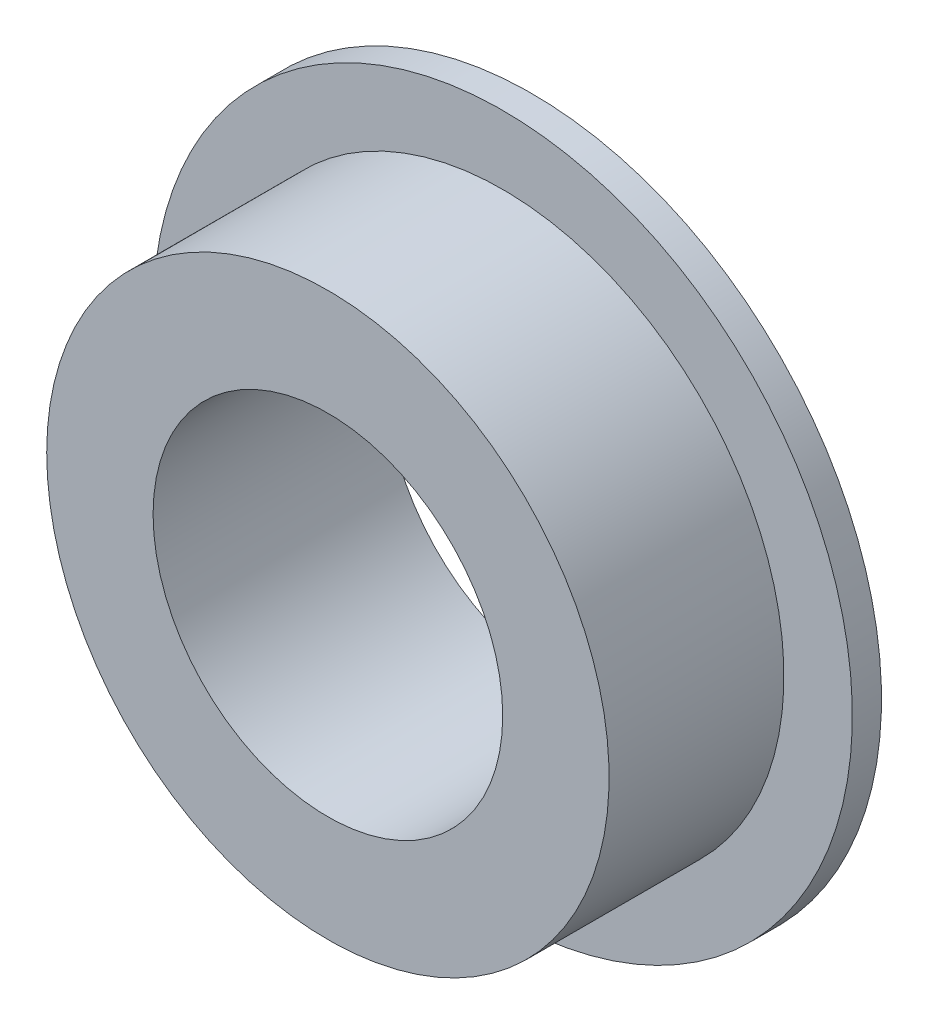
ISO-10303-21;
HEADER;
FILE_DESCRIPTION(('STEP AP214'),'2;1');
FILE_NAME('part.step','',(''),(''),'','','');
FILE_SCHEMA(('AUTOMOTIVE_DESIGN { 1 0 10303 214 1 1 1 1 }'));
ENDSEC;
DATA;
#1=APPLICATION_CONTEXT('core data for automotive mechanical design processes');
#2=APPLICATION_PROTOCOL_DEFINITION('international standard','automotive_design',2000,#1);
#3=PRODUCT_CONTEXT('',#1,'mechanical');
#4=PRODUCT('Part','Part','',(#3));
#5=PRODUCT_RELATED_PRODUCT_CATEGORY('part','',(#4));
#6=PRODUCT_DEFINITION_FORMATION('','',#4);
#7=PRODUCT_DEFINITION_CONTEXT('part definition',#1,'design');
#8=PRODUCT_DEFINITION('design','',#6,#7);
#9=PRODUCT_DEFINITION_SHAPE('','',#8);
#10=(LENGTH_UNIT() NAMED_UNIT(*) SI_UNIT(.MILLI.,.METRE.));
#11=(NAMED_UNIT(*) PLANE_ANGLE_UNIT() SI_UNIT($,.RADIAN.));
#12=(NAMED_UNIT(*) SI_UNIT($,.STERADIAN.) SOLID_ANGLE_UNIT());
#13=UNCERTAINTY_MEASURE_WITH_UNIT(LENGTH_MEASURE(1.E-05),#10,'distance_accuracy_value','');
#14=(GEOMETRIC_REPRESENTATION_CONTEXT(3) GLOBAL_UNCERTAINTY_ASSIGNED_CONTEXT((#13)) GLOBAL_UNIT_ASSIGNED_CONTEXT((#10,
#11,#12)) REPRESENTATION_CONTEXT('',''));
#15=CARTESIAN_POINT('',(0.,0.,0.));
#16=DIRECTION('',(0.,0.,1.));
#17=DIRECTION('',(1.,0.,0.));
#18=AXIS2_PLACEMENT_3D('',#15,#16,#17);
#19=CARTESIAN_POINT('',(0.,0.,12.7));
#20=DIRECTION('',(0.,0.,1.));
#21=DIRECTION('',(1.,0.,0.));
#22=AXIS2_PLACEMENT_3D('',#19,#20,#21);
#23=PLANE('',#22);
#24=CARTESIAN_POINT('',(0.,0.,12.7));
#25=DIRECTION('',(0.,0.,1.));
#26=DIRECTION('',(1.,0.,0.));
#27=AXIS2_PLACEMENT_3D('',#24,#25,#26);
#28=CIRCLE('',#27,9.525);
#29=CARTESIAN_POINT('',(9.525,0.,12.7));
#30=VERTEX_POINT('',#29);
#31=EDGE_CURVE('E10',#30,#30,#28,.T.);
#32=ORIENTED_EDGE('',*,*,#31,.F.);
#33=EDGE_LOOP('',(#32));
#34=FACE_BOUND('',#33,.T.);
#35=CARTESIAN_POINT('',(0.,0.,12.7));
#36=DIRECTION('',(0.,0.,-1.));
#37=DIRECTION('',(-1.,0.,0.));
#38=AXIS2_PLACEMENT_3D('',#35,#36,#37);
#39=CIRCLE('',#38,15.3209977787938);
#40=CARTESIAN_POINT('',(-15.3209977787938,0.,12.7));
#41=VERTEX_POINT('',#40);
#42=EDGE_CURVE('E54',#41,#41,#39,.T.);
#43=ORIENTED_EDGE('',*,*,#42,.F.);
#44=EDGE_LOOP('',(#43));
#45=FACE_BOUND('',#44,.T.);
#46=ADVANCED_FACE('F41',(#34,#45),#23,.T.);
#47=CARTESIAN_POINT('',(0.,0.,0.));
#48=DIRECTION('',(0.,0.,1.));
#49=DIRECTION('',(1.,0.,0.));
#50=AXIS2_PLACEMENT_3D('',#47,#48,#49);
#51=PLANE('',#50);
#52=CARTESIAN_POINT('',(0.,0.,0.));
#53=DIRECTION('',(0.,0.,1.));
#54=DIRECTION('',(1.,0.,0.));
#55=AXIS2_PLACEMENT_3D('',#52,#53,#54);
#56=CIRCLE('',#55,9.525);
#57=CARTESIAN_POINT('',(9.525,0.,0.));
#58=VERTEX_POINT('',#57);
#59=EDGE_CURVE('E45',#58,#58,#56,.T.);
#60=ORIENTED_EDGE('',*,*,#59,.T.);
#61=EDGE_LOOP('',(#60));
#62=FACE_BOUND('',#61,.T.);
#63=CARTESIAN_POINT('',(0.,0.,0.));
#64=DIRECTION('',(0.,0.,-1.));
#65=DIRECTION('',(-1.,0.,0.));
#66=AXIS2_PLACEMENT_3D('',#63,#64,#65);
#67=CIRCLE('',#66,12.7);
#68=CARTESIAN_POINT('',(-12.7,0.,0.));
#69=VERTEX_POINT('',#68);
#70=EDGE_CURVE('E61',#69,#69,#67,.T.);
#71=ORIENTED_EDGE('',*,*,#70,.T.);
#72=EDGE_LOOP('',(#71));
#73=FACE_BOUND('',#72,.T.);
#74=ADVANCED_FACE('F95',(#62,#73),#51,.F.);
#75=CARTESIAN_POINT('',(0.,0.,12.7));
#76=DIRECTION('',(0.,0.,-1.));
#77=DIRECTION('',(-1.,0.,0.));
#78=AXIS2_PLACEMENT_3D('',#75,#76,#77);
#79=CYLINDRICAL_SURFACE('',#78,9.525);
#80=ORIENTED_EDGE('',*,*,#31,.T.);
#81=EDGE_LOOP('',(#80));
#82=FACE_BOUND('',#81,.T.);
#83=ORIENTED_EDGE('',*,*,#59,.F.);
#84=EDGE_LOOP('',(#83));
#85=FACE_BOUND('',#84,.T.);
#86=ADVANCED_FACE('F102',(#82,#85),#79,.F.);
#87=CARTESIAN_POINT('',(0.,12.7,1.5875));
#88=DIRECTION('',(0.,0.,-1.));
#89=DIRECTION('',(-1.,0.,0.));
#90=AXIS2_PLACEMENT_3D('',#87,#88,#89);
#91=PLANE('',#90);
#92=CARTESIAN_POINT('',(0.,0.,1.5875));
#93=DIRECTION('',(0.,0.,-1.));
#94=DIRECTION('',(-1.,0.,0.));
#95=AXIS2_PLACEMENT_3D('',#92,#93,#94);
#96=CIRCLE('',#95,19.05);
#97=CARTESIAN_POINT('',(-19.05,0.,1.5875));
#98=VERTEX_POINT('',#97);
#99=EDGE_CURVE('E65',#98,#98,#96,.T.);
#100=ORIENTED_EDGE('',*,*,#99,.T.);
#101=EDGE_LOOP('',(#100));
#102=FACE_BOUND('',#101,.T.);
#103=CARTESIAN_POINT('',(0.,0.,1.5875));
#104=DIRECTION('',(0.,0.,-1.));
#105=DIRECTION('',(-1.,0.,0.));
#106=AXIS2_PLACEMENT_3D('',#103,#104,#105);
#107=CIRCLE('',#106,12.7);
#108=CARTESIAN_POINT('',(-12.7,0.,1.5875));
#109=VERTEX_POINT('',#108);
#110=EDGE_CURVE('E56',#109,#109,#107,.T.);
#111=ORIENTED_EDGE('',*,*,#110,.F.);
#112=EDGE_LOOP('',(#111));
#113=FACE_BOUND('',#112,.T.);
#114=ADVANCED_FACE('F107',(#102,#113),#91,.T.);
#115=CARTESIAN_POINT('',(0.,0.,0.));
#116=DIRECTION('',(0.,0.,-1.));
#117=DIRECTION('',(-1.,0.,0.));
#118=AXIS2_PLACEMENT_3D('',#115,#116,#117);
#119=CYLINDRICAL_SURFACE('',#118,12.7);
#120=ORIENTED_EDGE('',*,*,#110,.T.);
#121=EDGE_LOOP('',(#120));
#122=FACE_BOUND('',#121,.T.);
#123=ORIENTED_EDGE('',*,*,#70,.F.);
#124=EDGE_LOOP('',(#123));
#125=FACE_BOUND('',#124,.T.);
#126=ADVANCED_FACE('F91',(#122,#125),#119,.T.);
#127=CARTESIAN_POINT('',(0.,0.,0.));
#128=DIRECTION('',(0.,0.,-1.));
#129=DIRECTION('',(-1.,0.,0.));
#130=AXIS2_PLACEMENT_3D('',#127,#128,#129);
#131=CYLINDRICAL_SURFACE('',#130,15.3209977787938);
#132=ORIENTED_EDGE('',*,*,#42,.T.);
#133=EDGE_LOOP('',(#132));
#134=FACE_BOUND('',#133,.T.);
#135=CARTESIAN_POINT('',(0.,0.,3.175));
#136=DIRECTION('',(0.,0.,-1.));
#137=DIRECTION('',(-1.,0.,0.));
#138=AXIS2_PLACEMENT_3D('',#135,#136,#137);
#139=CIRCLE('',#138,15.3209977787938);
#140=CARTESIAN_POINT('',(-15.3209977787938,0.,3.175));
#141=VERTEX_POINT('',#140);
#142=EDGE_CURVE('E72',#141,#141,#139,.T.);
#143=ORIENTED_EDGE('',*,*,#142,.F.);
#144=EDGE_LOOP('',(#143));
#145=FACE_BOUND('',#144,.T.);
#146=ADVANCED_FACE('F83',(#134,#145),#131,.T.);
#147=CARTESIAN_POINT('',(0.,0.,3.17500000000001));
#148=DIRECTION('',(0.,0.,1.));
#149=DIRECTION('',(1.,0.,0.));
#150=AXIS2_PLACEMENT_3D('',#147,#148,#149);
#151=PLANE('',#150);
#152=ORIENTED_EDGE('',*,*,#142,.T.);
#153=EDGE_LOOP('',(#152));
#154=FACE_BOUND('',#153,.T.);
#155=CARTESIAN_POINT('',(0.,0.,3.17500000000001));
#156=DIRECTION('',(0.,0.,-1.));
#157=DIRECTION('',(-1.,0.,0.));
#158=AXIS2_PLACEMENT_3D('',#155,#156,#157);
#159=CIRCLE('',#158,19.05);
#160=CARTESIAN_POINT('',(-19.05,0.,3.17500000000001));
#161=VERTEX_POINT('',#160);
#162=EDGE_CURVE('E60',#161,#161,#159,.T.);
#163=ORIENTED_EDGE('',*,*,#162,.F.);
#164=EDGE_LOOP('',(#163));
#165=FACE_BOUND('',#164,.T.);
#166=ADVANCED_FACE('F81',(#154,#165),#151,.T.);
#167=CARTESIAN_POINT('',(0.,0.,12.7));
#168=DIRECTION('',(0.,0.,-1.));
#169=DIRECTION('',(-1.,0.,0.));
#170=AXIS2_PLACEMENT_3D('',#167,#168,#169);
#171=CYLINDRICAL_SURFACE('',#170,19.05);
#172=ORIENTED_EDGE('',*,*,#99,.F.);
#173=EDGE_LOOP('',(#172));
#174=FACE_BOUND('',#173,.T.);
#175=ORIENTED_EDGE('',*,*,#162,.T.);
#176=EDGE_LOOP('',(#175));
#177=FACE_BOUND('',#176,.T.);
#178=ADVANCED_FACE('F43',(#174,#177),#171,.T.);
#179=CLOSED_SHELL('',(#46,#74,#86,#114,#126,#146,#166,#178));
#180=MANIFOLD_SOLID_BREP('B2',#179);
#181=ADVANCED_BREP_SHAPE_REPRESENTATION('',(#18,#180),#14);
#182=SHAPE_DEFINITION_REPRESENTATION(#9,#181);
ENDSEC;
END-ISO-10303-21;
